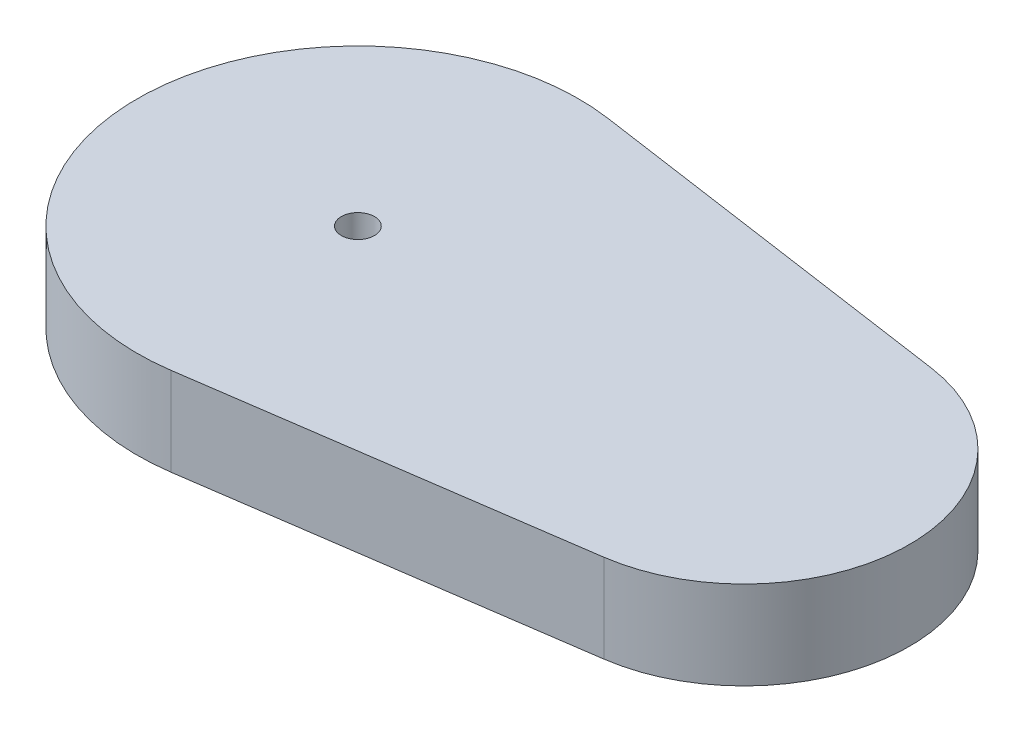
ISO-10303-21;
HEADER;
FILE_DESCRIPTION(('STEP AP214'),'2;1');
FILE_NAME('part.step','',(''),(''),'','','');
FILE_SCHEMA(('AUTOMOTIVE_DESIGN { 1 0 10303 214 1 1 1 1 }'));
ENDSEC;
DATA;
#1=APPLICATION_CONTEXT('core data for automotive mechanical design processes');
#2=APPLICATION_PROTOCOL_DEFINITION('international standard','automotive_design',2000,#1);
#3=PRODUCT_CONTEXT('',#1,'mechanical');
#4=PRODUCT('Part','Part','',(#3));
#5=PRODUCT_RELATED_PRODUCT_CATEGORY('part','',(#4));
#6=PRODUCT_DEFINITION_FORMATION('','',#4);
#7=PRODUCT_DEFINITION_CONTEXT('part definition',#1,'design');
#8=PRODUCT_DEFINITION('design','',#6,#7);
#9=PRODUCT_DEFINITION_SHAPE('','',#8);
#10=(LENGTH_UNIT() NAMED_UNIT(*) SI_UNIT(.MILLI.,.METRE.));
#11=(NAMED_UNIT(*) PLANE_ANGLE_UNIT() SI_UNIT($,.RADIAN.));
#12=(NAMED_UNIT(*) SI_UNIT($,.STERADIAN.) SOLID_ANGLE_UNIT());
#13=UNCERTAINTY_MEASURE_WITH_UNIT(LENGTH_MEASURE(1.E-05),#10,'distance_accuracy_value','');
#14=(GEOMETRIC_REPRESENTATION_CONTEXT(3) GLOBAL_UNCERTAINTY_ASSIGNED_CONTEXT((#13)) GLOBAL_UNIT_ASSIGNED_CONTEXT((#10,
#11,#12)) REPRESENTATION_CONTEXT('',''));
#15=CARTESIAN_POINT('',(0.,0.,0.));
#16=DIRECTION('',(0.,0.,1.));
#17=DIRECTION('',(1.,0.,0.));
#18=AXIS2_PLACEMENT_3D('',#15,#16,#17);
#19=CARTESIAN_POINT('',(14.,3.20000000000001,0.));
#20=DIRECTION('',(0.,-1.,0.));
#21=DIRECTION('',(0.,0.,-1.));
#22=AXIS2_PLACEMENT_3D('',#19,#20,#21);
#23=CYLINDRICAL_SURFACE('',#22,6.);
#24=CARTESIAN_POINT('',(14.,0.,0.));
#25=DIRECTION('',(0.,1.,0.));
#26=DIRECTION('',(0.,0.,1.));
#27=AXIS2_PLACEMENT_3D('',#24,#25,#26);
#28=CIRCLE('',#27,6.);
#29=CARTESIAN_POINT('',(14.8571428571429,0.,-5.93845991166472));
#30=VERTEX_POINT('',#29);
#31=CARTESIAN_POINT('',(14.8571428571429,0.,5.93845991166472));
#32=VERTEX_POINT('',#31);
#33=EDGE_CURVE('E119',#30,#32,#28,.F.);
#34=ORIENTED_EDGE('',*,*,#33,.F.);
#35=DIRECTION('',(0.,-1.,0.));
#36=VECTOR('',#35,1.);
#37=CARTESIAN_POINT('',(14.8571428571429,3.20000000000001,-5.93845991166472));
#38=LINE('',#37,#36);
#39=CARTESIAN_POINT('',(14.8571428571429,3.20000000000001,-5.93845991166472));
#40=VERTEX_POINT('',#39);
#41=EDGE_CURVE('E11',#40,#30,#38,.T.);
#42=ORIENTED_EDGE('',*,*,#41,.F.);
#43=CARTESIAN_POINT('',(14.,3.20000000000001,0.));
#44=DIRECTION('',(0.,1.,0.));
#45=DIRECTION('',(0.,0.,1.));
#46=AXIS2_PLACEMENT_3D('',#43,#44,#45);
#47=CIRCLE('',#46,6.);
#48=CARTESIAN_POINT('',(14.8571428571429,3.20000000000001,5.93845991166472));
#49=VERTEX_POINT('',#48);
#50=EDGE_CURVE('E106',#40,#49,#47,.F.);
#51=ORIENTED_EDGE('',*,*,#50,.T.);
#52=DIRECTION('',(0.,-1.,0.));
#53=VECTOR('',#52,1.);
#54=CARTESIAN_POINT('',(14.8571428571429,3.20000000000001,5.93845991166472));
#55=LINE('',#54,#53);
#56=EDGE_CURVE('E84',#49,#32,#55,.T.);
#57=ORIENTED_EDGE('',*,*,#56,.T.);
#58=EDGE_LOOP('',(#34,#42,#51,#57));
#59=FACE_BOUND('',#58,.T.);
#60=ADVANCED_FACE('F45',(#59),#23,.T.);
#61=CARTESIAN_POINT('',(1.14285714285714,3.20000000000001,-7.91794654888629));
#62=DIRECTION('',(0.142857142857143,0.,-0.989743318610787));
#63=DIRECTION('',(-0.989743318610787,0.,-0.142857142857143));
#64=AXIS2_PLACEMENT_3D('',#61,#62,#63);
#65=PLANE('',#64);
#66=DIRECTION('',(0.989743318610787,0.,0.142857142857143));
#67=VECTOR('',#66,1.);
#68=CARTESIAN_POINT('',(1.14285714285714,0.,-7.91794654888629));
#69=LINE('',#68,#67);
#70=CARTESIAN_POINT('',(1.14285714285714,0.,-7.91794654888629));
#71=VERTEX_POINT('',#70);
#72=EDGE_CURVE('E97',#71,#30,#69,.T.);
#73=ORIENTED_EDGE('',*,*,#72,.F.);
#74=DIRECTION('',(0.,-1.,0.));
#75=VECTOR('',#74,1.);
#76=CARTESIAN_POINT('',(1.14285714285714,3.20000000000001,-7.91794654888629));
#77=LINE('',#76,#75);
#78=CARTESIAN_POINT('',(1.14285714285714,3.20000000000001,-7.91794654888629));
#79=VERTEX_POINT('',#78);
#80=EDGE_CURVE('E54',#79,#71,#77,.T.);
#81=ORIENTED_EDGE('',*,*,#80,.F.);
#82=DIRECTION('',(0.989743318610787,0.,0.142857142857143));
#83=VECTOR('',#82,1.);
#84=CARTESIAN_POINT('',(1.14285714285714,3.20000000000001,-7.91794654888629));
#85=LINE('',#84,#83);
#86=EDGE_CURVE('E95',#79,#40,#85,.T.);
#87=ORIENTED_EDGE('',*,*,#86,.T.);
#88=ORIENTED_EDGE('',*,*,#41,.T.);
#89=EDGE_LOOP('',(#73,#81,#87,#88));
#90=FACE_BOUND('',#89,.T.);
#91=ADVANCED_FACE('F93',(#90),#65,.T.);
#92=CARTESIAN_POINT('',(0.,3.20000000000001,0.));
#93=DIRECTION('',(0.,-1.,0.));
#94=DIRECTION('',(0.,0.,-1.));
#95=AXIS2_PLACEMENT_3D('',#92,#93,#94);
#96=CYLINDRICAL_SURFACE('',#95,8.);
#97=CARTESIAN_POINT('',(0.,0.,0.));
#98=DIRECTION('',(0.,1.,0.));
#99=DIRECTION('',(0.,0.,1.));
#100=AXIS2_PLACEMENT_3D('',#97,#98,#99);
#101=CIRCLE('',#100,8.);
#102=CARTESIAN_POINT('',(1.14285714285714,0.,7.91794654888629));
#103=VERTEX_POINT('',#102);
#104=EDGE_CURVE('E77',#71,#103,#101,.T.);
#105=ORIENTED_EDGE('',*,*,#104,.T.);
#106=DIRECTION('',(0.,-1.,0.));
#107=VECTOR('',#106,1.);
#108=CARTESIAN_POINT('',(1.14285714285714,3.20000000000001,7.91794654888629));
#109=LINE('',#108,#107);
#110=CARTESIAN_POINT('',(1.14285714285714,3.20000000000001,7.91794654888629));
#111=VERTEX_POINT('',#110);
#112=EDGE_CURVE('E99',#111,#103,#109,.T.);
#113=ORIENTED_EDGE('',*,*,#112,.F.);
#114=CARTESIAN_POINT('',(0.,3.20000000000001,0.));
#115=DIRECTION('',(0.,1.,0.));
#116=DIRECTION('',(0.,0.,1.));
#117=AXIS2_PLACEMENT_3D('',#114,#115,#116);
#118=CIRCLE('',#117,8.);
#119=EDGE_CURVE('E100',#79,#111,#118,.T.);
#120=ORIENTED_EDGE('',*,*,#119,.F.);
#121=ORIENTED_EDGE('',*,*,#80,.T.);
#122=EDGE_LOOP('',(#105,#113,#120,#121));
#123=FACE_BOUND('',#122,.T.);
#124=ADVANCED_FACE('F101',(#123),#96,.T.);
#125=CARTESIAN_POINT('',(1.14285714285714,3.20000000000001,7.91794654888629));
#126=DIRECTION('',(-0.142857142857143,0.,-0.989743318610787));
#127=DIRECTION('',(-0.989743318610787,0.,0.142857142857143));
#128=AXIS2_PLACEMENT_3D('',#125,#126,#127);
#129=PLANE('',#128);
#130=DIRECTION('',(0.989743318610787,0.,-0.142857142857143));
#131=VECTOR('',#130,1.);
#132=CARTESIAN_POINT('',(1.14285714285714,0.,7.91794654888629));
#133=LINE('',#132,#131);
#134=EDGE_CURVE('E127',#103,#32,#133,.T.);
#135=ORIENTED_EDGE('',*,*,#134,.T.);
#136=ORIENTED_EDGE('',*,*,#56,.F.);
#137=DIRECTION('',(0.989743318610787,0.,-0.142857142857143));
#138=VECTOR('',#137,1.);
#139=CARTESIAN_POINT('',(1.14285714285714,3.20000000000001,7.91794654888629));
#140=LINE('',#139,#138);
#141=EDGE_CURVE('E62',#111,#49,#140,.T.);
#142=ORIENTED_EDGE('',*,*,#141,.F.);
#143=ORIENTED_EDGE('',*,*,#112,.T.);
#144=EDGE_LOOP('',(#135,#136,#142,#143));
#145=FACE_BOUND('',#144,.T.);
#146=ADVANCED_FACE('F138',(#145),#129,.F.);
#147=CARTESIAN_POINT('',(0.,3.20000000000001,0.));
#148=DIRECTION('',(0.,-1.,0.));
#149=DIRECTION('',(0.,0.,-1.));
#150=AXIS2_PLACEMENT_3D('',#147,#148,#149);
#151=CYLINDRICAL_SURFACE('',#150,0.6);
#152=CARTESIAN_POINT('',(0.,3.20000000000001,0.));
#153=DIRECTION('',(0.,1.,0.));
#154=DIRECTION('',(0.,0.,1.));
#155=AXIS2_PLACEMENT_3D('',#152,#153,#154);
#156=CIRCLE('',#155,0.6);
#157=CARTESIAN_POINT('',(0.,3.20000000000001,0.6));
#158=VERTEX_POINT('',#157);
#159=EDGE_CURVE('E115',#158,#158,#156,.T.);
#160=ORIENTED_EDGE('',*,*,#159,.T.);
#161=EDGE_LOOP('',(#160));
#162=FACE_BOUND('',#161,.T.);
#163=CARTESIAN_POINT('',(0.,0.,0.));
#164=DIRECTION('',(0.,1.,0.));
#165=DIRECTION('',(0.,0.,1.));
#166=AXIS2_PLACEMENT_3D('',#163,#164,#165);
#167=CIRCLE('',#166,0.6);
#168=CARTESIAN_POINT('',(0.,0.,0.6));
#169=VERTEX_POINT('',#168);
#170=EDGE_CURVE('E110',#169,#169,#167,.T.);
#171=ORIENTED_EDGE('',*,*,#170,.F.);
#172=EDGE_LOOP('',(#171));
#173=FACE_BOUND('',#172,.T.);
#174=ADVANCED_FACE('F153',(#162,#173),#151,.F.);
#175=CARTESIAN_POINT('',(0.,3.20000000000001,0.));
#176=DIRECTION('',(0.,1.,0.));
#177=DIRECTION('',(0.,0.,1.));
#178=AXIS2_PLACEMENT_3D('',#175,#176,#177);
#179=PLANE('',#178);
#180=ORIENTED_EDGE('',*,*,#50,.F.);
#181=ORIENTED_EDGE('',*,*,#86,.F.);
#182=ORIENTED_EDGE('',*,*,#119,.T.);
#183=ORIENTED_EDGE('',*,*,#141,.T.);
#184=EDGE_LOOP('',(#180,#181,#182,#183));
#185=FACE_BOUND('',#184,.T.);
#186=ORIENTED_EDGE('',*,*,#159,.F.);
#187=EDGE_LOOP('',(#186));
#188=FACE_BOUND('',#187,.T.);
#189=ADVANCED_FACE('F104',(#185,#188),#179,.T.);
#190=CARTESIAN_POINT('',(0.,0.,0.));
#191=DIRECTION('',(0.,1.,0.));
#192=DIRECTION('',(0.,0.,1.));
#193=AXIS2_PLACEMENT_3D('',#190,#191,#192);
#194=PLANE('',#193);
#195=ORIENTED_EDGE('',*,*,#33,.T.);
#196=ORIENTED_EDGE('',*,*,#134,.F.);
#197=ORIENTED_EDGE('',*,*,#104,.F.);
#198=ORIENTED_EDGE('',*,*,#72,.T.);
#199=EDGE_LOOP('',(#195,#196,#197,#198));
#200=FACE_BOUND('',#199,.T.);
#201=ORIENTED_EDGE('',*,*,#170,.T.);
#202=EDGE_LOOP('',(#201));
#203=FACE_BOUND('',#202,.T.);
#204=ADVANCED_FACE('F140',(#200,#203),#194,.F.);
#205=CLOSED_SHELL('',(#60,#91,#124,#146,#174,#189,#204));
#206=MANIFOLD_SOLID_BREP('B2',#205);
#207=ADVANCED_BREP_SHAPE_REPRESENTATION('',(#18,#206),#14);
#208=SHAPE_DEFINITION_REPRESENTATION(#9,#207);
ENDSEC;
END-ISO-10303-21;
